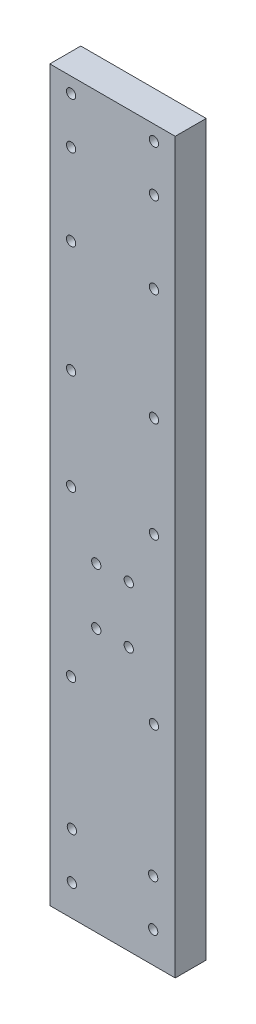
ISO-10303-21;
HEADER;
FILE_DESCRIPTION(('STEP AP214'),'2;1');
FILE_NAME('part.step','',(''),(''),'','','');
FILE_SCHEMA(('AUTOMOTIVE_DESIGN { 1 0 10303 214 1 1 1 1 }'));
ENDSEC;
DATA;
#1=APPLICATION_CONTEXT('core data for automotive mechanical design processes');
#2=APPLICATION_PROTOCOL_DEFINITION('international standard','automotive_design',2000,#1);
#3=PRODUCT_CONTEXT('',#1,'mechanical');
#4=PRODUCT('Part','Part','',(#3));
#5=PRODUCT_RELATED_PRODUCT_CATEGORY('part','',(#4));
#6=PRODUCT_DEFINITION_FORMATION('','',#4);
#7=PRODUCT_DEFINITION_CONTEXT('part definition',#1,'design');
#8=PRODUCT_DEFINITION('design','',#6,#7);
#9=PRODUCT_DEFINITION_SHAPE('','',#8);
#10=(LENGTH_UNIT() NAMED_UNIT(*) SI_UNIT(.MILLI.,.METRE.));
#11=(NAMED_UNIT(*) PLANE_ANGLE_UNIT() SI_UNIT($,.RADIAN.));
#12=(NAMED_UNIT(*) SI_UNIT($,.STERADIAN.) SOLID_ANGLE_UNIT());
#13=UNCERTAINTY_MEASURE_WITH_UNIT(LENGTH_MEASURE(1.E-05),#10,'distance_accuracy_value','');
#14=(GEOMETRIC_REPRESENTATION_CONTEXT(3) GLOBAL_UNCERTAINTY_ASSIGNED_CONTEXT((#13)) GLOBAL_UNIT_ASSIGNED_CONTEXT((#10,
#11,#12)) REPRESENTATION_CONTEXT('',''));
#15=CARTESIAN_POINT('',(0.,0.,0.));
#16=DIRECTION('',(0.,0.,1.));
#17=DIRECTION('',(1.,0.,0.));
#18=AXIS2_PLACEMENT_3D('',#15,#16,#17);
#19=CARTESIAN_POINT('',(0.,0.,4.));
#20=DIRECTION('',(0.,0.,-1.));
#21=DIRECTION('',(-1.,0.,0.));
#22=AXIS2_PLACEMENT_3D('',#19,#20,#21);
#23=PLANE('',#22);
#24=CARTESIAN_POINT('',(2.7500000000009,92.0614488310554,4.));
#25=DIRECTION('',(0.,0.,1.));
#26=DIRECTION('',(-1.,0.,0.));
#27=AXIS2_PLACEMENT_3D('',#24,#25,#26);
#28=CIRCLE('',#27,0.600000000000001);
#29=CARTESIAN_POINT('',(2.1500000000009,92.0614488310554,4.));
#30=VERTEX_POINT('',#29);
#31=EDGE_CURVE('E217',#30,#30,#28,.T.);
#32=ORIENTED_EDGE('',*,*,#31,.F.);
#33=EDGE_LOOP('',(#32));
#34=FACE_BOUND('',#33,.T.);
#35=CARTESIAN_POINT('',(13.4500000000022,86.0614488310554,4.));
#36=DIRECTION('',(0.,0.,1.));
#37=DIRECTION('',(1.,0.,0.));
#38=AXIS2_PLACEMENT_3D('',#35,#36,#37);
#39=CIRCLE('',#38,0.600000000000001);
#40=CARTESIAN_POINT('',(14.0500000000022,86.0614488310554,4.));
#41=VERTEX_POINT('',#40);
#42=EDGE_CURVE('E205',#41,#41,#39,.T.);
#43=ORIENTED_EDGE('',*,*,#42,.F.);
#44=EDGE_LOOP('',(#43));
#45=FACE_BOUND('',#44,.T.);
#46=CARTESIAN_POINT('',(13.4500000000001,75.5614488310554,4.));
#47=DIRECTION('',(0.,0.,1.));
#48=DIRECTION('',(1.,0.,0.));
#49=AXIS2_PLACEMENT_3D('',#46,#47,#48);
#50=CIRCLE('',#49,0.600000000000001);
#51=CARTESIAN_POINT('',(14.0500000000001,75.5614488310554,4.));
#52=VERTEX_POINT('',#51);
#53=EDGE_CURVE('E193',#52,#52,#50,.T.);
#54=ORIENTED_EDGE('',*,*,#53,.F.);
#55=EDGE_LOOP('',(#54));
#56=FACE_BOUND('',#55,.T.);
#57=CARTESIAN_POINT('',(13.350000000001,3.84644883105539,4.));
#58=DIRECTION('',(0.,0.,1.));
#59=DIRECTION('',(-1.,0.,0.));
#60=AXIS2_PLACEMENT_3D('',#57,#58,#59);
#61=CIRCLE('',#60,0.6);
#62=CARTESIAN_POINT('',(12.750000000001,3.84644883105539,4.));
#63=VERTEX_POINT('',#62);
#64=EDGE_CURVE('E181',#63,#63,#61,.T.);
#65=ORIENTED_EDGE('',*,*,#64,.F.);
#66=EDGE_LOOP('',(#65));
#67=FACE_BOUND('',#66,.T.);
#68=CARTESIAN_POINT('',(2.84999999999999,3.84644883105539,4.));
#69=DIRECTION('',(0.,0.,1.));
#70=DIRECTION('',(1.,0.,0.));
#71=AXIS2_PLACEMENT_3D('',#68,#69,#70);
#72=CIRCLE('',#71,0.6);
#73=CARTESIAN_POINT('',(3.44999999999999,3.84644883105539,4.));
#74=VERTEX_POINT('',#73);
#75=EDGE_CURVE('E169',#74,#74,#72,.T.);
#76=ORIENTED_EDGE('',*,*,#75,.F.);
#77=EDGE_LOOP('',(#76));
#78=FACE_BOUND('',#77,.T.);
#79=CARTESIAN_POINT('',(2.85,9.84644883105539,4.));
#80=DIRECTION('',(0.,0.,1.));
#81=DIRECTION('',(1.,0.,0.));
#82=AXIS2_PLACEMENT_3D('',#79,#80,#81);
#83=CIRCLE('',#82,0.6);
#84=CARTESIAN_POINT('',(3.45,9.84644883105539,4.));
#85=VERTEX_POINT('',#84);
#86=EDGE_CURVE('E157',#85,#85,#83,.T.);
#87=ORIENTED_EDGE('',*,*,#86,.F.);
#88=EDGE_LOOP('',(#87));
#89=FACE_BOUND('',#88,.T.);
#90=CARTESIAN_POINT('',(13.4500000000001,48.1064488310554,4.));
#91=DIRECTION('',(0.,0.,1.));
#92=DIRECTION('',(1.,0.,0.));
#93=AXIS2_PLACEMENT_3D('',#90,#91,#92);
#94=CIRCLE('',#93,0.600000000000001);
#95=CARTESIAN_POINT('',(14.0500000000001,48.1064488310554,4.));
#96=VERTEX_POINT('',#95);
#97=EDGE_CURVE('E145',#96,#96,#94,.T.);
#98=ORIENTED_EDGE('',*,*,#97,.F.);
#99=EDGE_LOOP('',(#98));
#100=FACE_BOUND('',#99,.T.);
#101=CARTESIAN_POINT('',(13.4500000000001,26.8464488310553,4.));
#102=DIRECTION('',(0.,0.,1.));
#103=DIRECTION('',(1.,0.,0.));
#104=AXIS2_PLACEMENT_3D('',#101,#102,#103);
#105=CIRCLE('',#104,0.6);
#106=CARTESIAN_POINT('',(14.0500000000001,26.8464488310553,4.));
#107=VERTEX_POINT('',#106);
#108=EDGE_CURVE('E133',#107,#107,#105,.T.);
#109=ORIENTED_EDGE('',*,*,#108,.F.);
#110=EDGE_LOOP('',(#109));
#111=FACE_BOUND('',#110,.T.);
#112=CARTESIAN_POINT('',(10.2000000000001,33.846448831055,4.));
#113=DIRECTION('',(0.,0.,1.));
#114=DIRECTION('',(1.,0.,0.));
#115=AXIS2_PLACEMENT_3D('',#112,#113,#114);
#116=CIRCLE('',#115,0.600000000000001);
#117=CARTESIAN_POINT('',(10.8000000000001,33.846448831055,4.));
#118=VERTEX_POINT('',#117);
#119=EDGE_CURVE('E121',#118,#118,#116,.T.);
#120=ORIENTED_EDGE('',*,*,#119,.F.);
#121=EDGE_LOOP('',(#120));
#122=FACE_BOUND('',#121,.T.);
#123=CARTESIAN_POINT('',(10.2000000000001,41.1664488310547,4.));
#124=DIRECTION('',(0.,0.,1.));
#125=DIRECTION('',(1.,0.,0.));
#126=AXIS2_PLACEMENT_3D('',#123,#124,#125);
#127=CIRCLE('',#126,0.600000000000001);
#128=CARTESIAN_POINT('',(10.8000000000001,41.1664488310547,4.));
#129=VERTEX_POINT('',#128);
#130=EDGE_CURVE('E100',#129,#129,#127,.T.);
#131=ORIENTED_EDGE('',*,*,#130,.F.);
#132=EDGE_LOOP('',(#131));
#133=FACE_BOUND('',#132,.T.);
#134=DIRECTION('',(1.,0.,0.));
#135=VECTOR('',#134,1.);
#136=CARTESIAN_POINT('',(0.,-0.15355116894461,4.));
#137=LINE('',#136,#135);
#138=CARTESIAN_POINT('',(0.,-0.15355116894461,4.));
#139=VERTEX_POINT('',#138);
#140=CARTESIAN_POINT('',(16.2,-0.15355116894461,4.));
#141=VERTEX_POINT('',#140);
#142=EDGE_CURVE('E85',#139,#141,#137,.T.);
#143=ORIENTED_EDGE('',*,*,#142,.T.);
#144=DIRECTION('',(0.,1.,0.));
#145=VECTOR('',#144,1.);
#146=CARTESIAN_POINT('',(16.2,94.0064488310554,4.));
#147=LINE('',#146,#145);
#148=CARTESIAN_POINT('',(16.2,94.0064488310554,4.));
#149=VERTEX_POINT('',#148);
#150=EDGE_CURVE('E80',#141,#149,#147,.T.);
#151=ORIENTED_EDGE('',*,*,#150,.T.);
#152=DIRECTION('',(-1.,0.,0.));
#153=VECTOR('',#152,1.);
#154=CARTESIAN_POINT('',(0.,94.0064488310554,4.));
#155=LINE('',#154,#153);
#156=CARTESIAN_POINT('',(0.,94.0064488310554,4.));
#157=VERTEX_POINT('',#156);
#158=EDGE_CURVE('E83',#149,#157,#155,.T.);
#159=ORIENTED_EDGE('',*,*,#158,.T.);
#160=DIRECTION('',(0.,-1.,0.));
#161=VECTOR('',#160,1.);
#162=CARTESIAN_POINT('',(0.,94.0064488310554,4.));
#163=LINE('',#162,#161);
#164=EDGE_CURVE('E50',#157,#139,#163,.T.);
#165=ORIENTED_EDGE('',*,*,#164,.T.);
#166=EDGE_LOOP('',(#143,#151,#159,#165));
#167=FACE_BOUND('',#166,.T.);
#168=CARTESIAN_POINT('',(6.,41.1064488310554,4.));
#169=DIRECTION('',(0.,0.,1.));
#170=DIRECTION('',(1.,0.,0.));
#171=AXIS2_PLACEMENT_3D('',#168,#169,#170);
#172=CIRCLE('',#171,0.600000000000001);
#173=CARTESIAN_POINT('',(6.6,41.1064488310554,4.));
#174=VERTEX_POINT('',#173);
#175=EDGE_CURVE('E115',#174,#174,#172,.T.);
#176=ORIENTED_EDGE('',*,*,#175,.F.);
#177=EDGE_LOOP('',(#176));
#178=FACE_BOUND('',#177,.T.);
#179=CARTESIAN_POINT('',(6.,33.846448831055,4.));
#180=DIRECTION('',(0.,0.,1.));
#181=DIRECTION('',(1.,0.,0.));
#182=AXIS2_PLACEMENT_3D('',#179,#180,#181);
#183=CIRCLE('',#182,0.600000000000001);
#184=CARTESIAN_POINT('',(6.6,33.846448831055,4.));
#185=VERTEX_POINT('',#184);
#186=EDGE_CURVE('E127',#185,#185,#183,.T.);
#187=ORIENTED_EDGE('',*,*,#186,.F.);
#188=EDGE_LOOP('',(#187));
#189=FACE_BOUND('',#188,.T.);
#190=CARTESIAN_POINT('',(2.75000000000002,26.8464488310555,4.));
#191=DIRECTION('',(0.,0.,1.));
#192=DIRECTION('',(1.,0.,0.));
#193=AXIS2_PLACEMENT_3D('',#190,#191,#192);
#194=CIRCLE('',#193,0.6);
#195=CARTESIAN_POINT('',(3.35000000000002,26.8464488310555,4.));
#196=VERTEX_POINT('',#195);
#197=EDGE_CURVE('E139',#196,#196,#194,.T.);
#198=ORIENTED_EDGE('',*,*,#197,.F.);
#199=EDGE_LOOP('',(#198));
#200=FACE_BOUND('',#199,.T.);
#201=CARTESIAN_POINT('',(2.75000000000002,48.1064488310554,4.));
#202=DIRECTION('',(0.,0.,1.));
#203=DIRECTION('',(1.,0.,0.));
#204=AXIS2_PLACEMENT_3D('',#201,#202,#203);
#205=CIRCLE('',#204,0.600000000000001);
#206=CARTESIAN_POINT('',(3.35000000000002,48.1064488310554,4.));
#207=VERTEX_POINT('',#206);
#208=EDGE_CURVE('E151',#207,#207,#205,.T.);
#209=ORIENTED_EDGE('',*,*,#208,.F.);
#210=EDGE_LOOP('',(#209));
#211=FACE_BOUND('',#210,.T.);
#212=CARTESIAN_POINT('',(13.4500000000016,61.1064488310554,4.));
#213=DIRECTION('',(0.,0.,1.));
#214=DIRECTION('',(1.,0.,0.));
#215=AXIS2_PLACEMENT_3D('',#212,#213,#214);
#216=CIRCLE('',#215,0.600000000000001);
#217=CARTESIAN_POINT('',(14.0500000000016,61.1064488310554,4.));
#218=VERTEX_POINT('',#217);
#219=EDGE_CURVE('E163',#218,#218,#216,.T.);
#220=ORIENTED_EDGE('',*,*,#219,.F.);
#221=EDGE_LOOP('',(#220));
#222=FACE_BOUND('',#221,.T.);
#223=CARTESIAN_POINT('',(13.350000000001,9.84644883105539,4.));
#224=DIRECTION('',(0.,0.,1.));
#225=DIRECTION('',(-1.,0.,0.));
#226=AXIS2_PLACEMENT_3D('',#223,#224,#225);
#227=CIRCLE('',#226,0.6);
#228=CARTESIAN_POINT('',(12.750000000001,9.84644883105539,4.));
#229=VERTEX_POINT('',#228);
#230=EDGE_CURVE('E175',#229,#229,#227,.T.);
#231=ORIENTED_EDGE('',*,*,#230,.F.);
#232=EDGE_LOOP('',(#231));
#233=FACE_BOUND('',#232,.T.);
#234=CARTESIAN_POINT('',(2.75000000000136,61.1064488310554,4.));
#235=DIRECTION('',(0.,0.,1.));
#236=DIRECTION('',(1.,0.,0.));
#237=AXIS2_PLACEMENT_3D('',#234,#235,#236);
#238=CIRCLE('',#237,0.600000000000001);
#239=CARTESIAN_POINT('',(3.35000000000136,61.1064488310554,4.));
#240=VERTEX_POINT('',#239);
#241=EDGE_CURVE('E187',#240,#240,#238,.T.);
#242=ORIENTED_EDGE('',*,*,#241,.F.);
#243=EDGE_LOOP('',(#242));
#244=FACE_BOUND('',#243,.T.);
#245=CARTESIAN_POINT('',(2.75000000000002,75.5614488310554,4.));
#246=DIRECTION('',(0.,0.,1.));
#247=DIRECTION('',(1.,0.,0.));
#248=AXIS2_PLACEMENT_3D('',#245,#246,#247);
#249=CIRCLE('',#248,0.600000000000001);
#250=CARTESIAN_POINT('',(3.35000000000002,75.5614488310554,4.));
#251=VERTEX_POINT('',#250);
#252=EDGE_CURVE('E199',#251,#251,#249,.T.);
#253=ORIENTED_EDGE('',*,*,#252,.F.);
#254=EDGE_LOOP('',(#253));
#255=FACE_BOUND('',#254,.T.);
#256=CARTESIAN_POINT('',(2.7500000000009,86.0614488310554,4.));
#257=DIRECTION('',(0.,0.,1.));
#258=DIRECTION('',(1.,0.,0.));
#259=AXIS2_PLACEMENT_3D('',#256,#257,#258);
#260=CIRCLE('',#259,0.600000000000001);
#261=CARTESIAN_POINT('',(3.3500000000009,86.0614488310554,4.));
#262=VERTEX_POINT('',#261);
#263=EDGE_CURVE('E211',#262,#262,#260,.T.);
#264=ORIENTED_EDGE('',*,*,#263,.F.);
#265=EDGE_LOOP('',(#264));
#266=FACE_BOUND('',#265,.T.);
#267=CARTESIAN_POINT('',(13.4500000000022,92.0614488310554,4.));
#268=DIRECTION('',(0.,0.,1.));
#269=DIRECTION('',(-1.,0.,0.));
#270=AXIS2_PLACEMENT_3D('',#267,#268,#269);
#271=CIRCLE('',#270,0.600000000000001);
#272=CARTESIAN_POINT('',(12.8500000000022,92.0614488310554,4.));
#273=VERTEX_POINT('',#272);
#274=EDGE_CURVE('E223',#273,#273,#271,.T.);
#275=ORIENTED_EDGE('',*,*,#274,.F.);
#276=EDGE_LOOP('',(#275));
#277=FACE_BOUND('',#276,.T.);
#278=ADVANCED_FACE('F33',(#34,#45,#56,#67,#78,#89,#100,#111,#122,#133,#167,#178,#189,#200,#211,
#222,#233,#244,#255,#266,#277),#23,.F.);
#279=CARTESIAN_POINT('',(0.,0.,0.));
#280=DIRECTION('',(0.,0.,-1.));
#281=DIRECTION('',(-1.,0.,0.));
#282=AXIS2_PLACEMENT_3D('',#279,#280,#281);
#283=PLANE('',#282);
#284=CARTESIAN_POINT('',(2.7500000000009,92.0614488310554,0.));
#285=DIRECTION('',(0.,0.,1.));
#286=DIRECTION('',(-1.,0.,0.));
#287=AXIS2_PLACEMENT_3D('',#284,#285,#286);
#288=CIRCLE('',#287,0.600000000000001);
#289=CARTESIAN_POINT('',(2.1500000000009,92.0614488310554,0.));
#290=VERTEX_POINT('',#289);
#291=EDGE_CURVE('E220',#290,#290,#288,.T.);
#292=ORIENTED_EDGE('',*,*,#291,.T.);
#293=EDGE_LOOP('',(#292));
#294=FACE_BOUND('',#293,.T.);
#295=CARTESIAN_POINT('',(13.4500000000022,86.0614488310554,0.));
#296=DIRECTION('',(0.,0.,1.));
#297=DIRECTION('',(1.,0.,0.));
#298=AXIS2_PLACEMENT_3D('',#295,#296,#297);
#299=CIRCLE('',#298,0.600000000000001);
#300=CARTESIAN_POINT('',(14.0500000000022,86.0614488310554,0.));
#301=VERTEX_POINT('',#300);
#302=EDGE_CURVE('E208',#301,#301,#299,.T.);
#303=ORIENTED_EDGE('',*,*,#302,.T.);
#304=EDGE_LOOP('',(#303));
#305=FACE_BOUND('',#304,.T.);
#306=CARTESIAN_POINT('',(13.4500000000001,75.5614488310554,0.));
#307=DIRECTION('',(0.,0.,1.));
#308=DIRECTION('',(1.,0.,0.));
#309=AXIS2_PLACEMENT_3D('',#306,#307,#308);
#310=CIRCLE('',#309,0.600000000000001);
#311=CARTESIAN_POINT('',(14.0500000000001,75.5614488310554,0.));
#312=VERTEX_POINT('',#311);
#313=EDGE_CURVE('E196',#312,#312,#310,.T.);
#314=ORIENTED_EDGE('',*,*,#313,.T.);
#315=EDGE_LOOP('',(#314));
#316=FACE_BOUND('',#315,.T.);
#317=CARTESIAN_POINT('',(13.350000000001,3.84644883105539,0.));
#318=DIRECTION('',(0.,0.,1.));
#319=DIRECTION('',(-1.,0.,0.));
#320=AXIS2_PLACEMENT_3D('',#317,#318,#319);
#321=CIRCLE('',#320,0.6);
#322=CARTESIAN_POINT('',(12.750000000001,3.84644883105539,0.));
#323=VERTEX_POINT('',#322);
#324=EDGE_CURVE('E184',#323,#323,#321,.T.);
#325=ORIENTED_EDGE('',*,*,#324,.T.);
#326=EDGE_LOOP('',(#325));
#327=FACE_BOUND('',#326,.T.);
#328=CARTESIAN_POINT('',(2.84999999999999,3.84644883105539,0.));
#329=DIRECTION('',(0.,0.,1.));
#330=DIRECTION('',(1.,0.,0.));
#331=AXIS2_PLACEMENT_3D('',#328,#329,#330);
#332=CIRCLE('',#331,0.6);
#333=CARTESIAN_POINT('',(3.44999999999999,3.84644883105539,0.));
#334=VERTEX_POINT('',#333);
#335=EDGE_CURVE('E172',#334,#334,#332,.T.);
#336=ORIENTED_EDGE('',*,*,#335,.T.);
#337=EDGE_LOOP('',(#336));
#338=FACE_BOUND('',#337,.T.);
#339=CARTESIAN_POINT('',(2.85,9.84644883105539,0.));
#340=DIRECTION('',(0.,0.,1.));
#341=DIRECTION('',(1.,0.,0.));
#342=AXIS2_PLACEMENT_3D('',#339,#340,#341);
#343=CIRCLE('',#342,0.6);
#344=CARTESIAN_POINT('',(3.45,9.84644883105539,0.));
#345=VERTEX_POINT('',#344);
#346=EDGE_CURVE('E160',#345,#345,#343,.T.);
#347=ORIENTED_EDGE('',*,*,#346,.T.);
#348=EDGE_LOOP('',(#347));
#349=FACE_BOUND('',#348,.T.);
#350=CARTESIAN_POINT('',(13.4500000000001,48.1064488310554,0.));
#351=DIRECTION('',(0.,0.,1.));
#352=DIRECTION('',(1.,0.,0.));
#353=AXIS2_PLACEMENT_3D('',#350,#351,#352);
#354=CIRCLE('',#353,0.600000000000001);
#355=CARTESIAN_POINT('',(14.0500000000001,48.1064488310554,0.));
#356=VERTEX_POINT('',#355);
#357=EDGE_CURVE('E148',#356,#356,#354,.T.);
#358=ORIENTED_EDGE('',*,*,#357,.T.);
#359=EDGE_LOOP('',(#358));
#360=FACE_BOUND('',#359,.T.);
#361=CARTESIAN_POINT('',(13.4500000000001,26.8464488310553,0.));
#362=DIRECTION('',(0.,0.,1.));
#363=DIRECTION('',(1.,0.,0.));
#364=AXIS2_PLACEMENT_3D('',#361,#362,#363);
#365=CIRCLE('',#364,0.6);
#366=CARTESIAN_POINT('',(14.0500000000001,26.8464488310553,0.));
#367=VERTEX_POINT('',#366);
#368=EDGE_CURVE('E136',#367,#367,#365,.T.);
#369=ORIENTED_EDGE('',*,*,#368,.T.);
#370=EDGE_LOOP('',(#369));
#371=FACE_BOUND('',#370,.T.);
#372=CARTESIAN_POINT('',(10.2000000000001,33.846448831055,0.));
#373=DIRECTION('',(0.,0.,1.));
#374=DIRECTION('',(1.,0.,0.));
#375=AXIS2_PLACEMENT_3D('',#372,#373,#374);
#376=CIRCLE('',#375,0.600000000000001);
#377=CARTESIAN_POINT('',(10.8000000000001,33.846448831055,0.));
#378=VERTEX_POINT('',#377);
#379=EDGE_CURVE('E124',#378,#378,#376,.T.);
#380=ORIENTED_EDGE('',*,*,#379,.T.);
#381=EDGE_LOOP('',(#380));
#382=FACE_BOUND('',#381,.T.);
#383=CARTESIAN_POINT('',(10.2000000000001,41.1664488310547,0.));
#384=DIRECTION('',(0.,0.,1.));
#385=DIRECTION('',(1.,0.,0.));
#386=AXIS2_PLACEMENT_3D('',#383,#384,#385);
#387=CIRCLE('',#386,0.600000000000001);
#388=CARTESIAN_POINT('',(10.8000000000001,41.1664488310547,0.));
#389=VERTEX_POINT('',#388);
#390=EDGE_CURVE('E112',#389,#389,#387,.T.);
#391=ORIENTED_EDGE('',*,*,#390,.T.);
#392=EDGE_LOOP('',(#391));
#393=FACE_BOUND('',#392,.T.);
#394=DIRECTION('',(1.,0.,0.));
#395=VECTOR('',#394,1.);
#396=CARTESIAN_POINT('',(0.,-0.15355116894461,0.));
#397=LINE('',#396,#395);
#398=CARTESIAN_POINT('',(0.,-0.15355116894461,0.));
#399=VERTEX_POINT('',#398);
#400=CARTESIAN_POINT('',(16.2,-0.15355116894461,0.));
#401=VERTEX_POINT('',#400);
#402=EDGE_CURVE('E97',#399,#401,#397,.T.);
#403=ORIENTED_EDGE('',*,*,#402,.F.);
#404=DIRECTION('',(0.,-1.,0.));
#405=VECTOR('',#404,1.);
#406=CARTESIAN_POINT('',(0.,94.0064488310554,0.));
#407=LINE('',#406,#405);
#408=CARTESIAN_POINT('',(0.,94.0064488310554,0.));
#409=VERTEX_POINT('',#408);
#410=EDGE_CURVE('E73',#409,#399,#407,.T.);
#411=ORIENTED_EDGE('',*,*,#410,.F.);
#412=DIRECTION('',(-1.,0.,0.));
#413=VECTOR('',#412,1.);
#414=CARTESIAN_POINT('',(0.,94.0064488310554,0.));
#415=LINE('',#414,#413);
#416=CARTESIAN_POINT('',(16.2,94.0064488310554,0.));
#417=VERTEX_POINT('',#416);
#418=EDGE_CURVE('E67',#417,#409,#415,.T.);
#419=ORIENTED_EDGE('',*,*,#418,.F.);
#420=DIRECTION('',(0.,1.,0.));
#421=VECTOR('',#420,1.);
#422=CARTESIAN_POINT('',(16.2,94.0064488310554,0.));
#423=LINE('',#422,#421);
#424=EDGE_CURVE('E89',#401,#417,#423,.T.);
#425=ORIENTED_EDGE('',*,*,#424,.F.);
#426=EDGE_LOOP('',(#403,#411,#419,#425));
#427=FACE_BOUND('',#426,.T.);
#428=CARTESIAN_POINT('',(6.,41.1064488310554,0.));
#429=DIRECTION('',(0.,0.,1.));
#430=DIRECTION('',(1.,0.,0.));
#431=AXIS2_PLACEMENT_3D('',#428,#429,#430);
#432=CIRCLE('',#431,0.600000000000001);
#433=CARTESIAN_POINT('',(6.6,41.1064488310554,0.));
#434=VERTEX_POINT('',#433);
#435=EDGE_CURVE('E118',#434,#434,#432,.T.);
#436=ORIENTED_EDGE('',*,*,#435,.T.);
#437=EDGE_LOOP('',(#436));
#438=FACE_BOUND('',#437,.T.);
#439=CARTESIAN_POINT('',(6.,33.846448831055,0.));
#440=DIRECTION('',(0.,0.,1.));
#441=DIRECTION('',(1.,0.,0.));
#442=AXIS2_PLACEMENT_3D('',#439,#440,#441);
#443=CIRCLE('',#442,0.600000000000001);
#444=CARTESIAN_POINT('',(6.6,33.846448831055,0.));
#445=VERTEX_POINT('',#444);
#446=EDGE_CURVE('E130',#445,#445,#443,.T.);
#447=ORIENTED_EDGE('',*,*,#446,.T.);
#448=EDGE_LOOP('',(#447));
#449=FACE_BOUND('',#448,.T.);
#450=CARTESIAN_POINT('',(2.75000000000002,26.8464488310555,0.));
#451=DIRECTION('',(0.,0.,1.));
#452=DIRECTION('',(1.,0.,0.));
#453=AXIS2_PLACEMENT_3D('',#450,#451,#452);
#454=CIRCLE('',#453,0.6);
#455=CARTESIAN_POINT('',(3.35000000000002,26.8464488310555,0.));
#456=VERTEX_POINT('',#455);
#457=EDGE_CURVE('E142',#456,#456,#454,.T.);
#458=ORIENTED_EDGE('',*,*,#457,.T.);
#459=EDGE_LOOP('',(#458));
#460=FACE_BOUND('',#459,.T.);
#461=CARTESIAN_POINT('',(2.75000000000002,48.1064488310554,0.));
#462=DIRECTION('',(0.,0.,1.));
#463=DIRECTION('',(1.,0.,0.));
#464=AXIS2_PLACEMENT_3D('',#461,#462,#463);
#465=CIRCLE('',#464,0.600000000000001);
#466=CARTESIAN_POINT('',(3.35000000000002,48.1064488310554,0.));
#467=VERTEX_POINT('',#466);
#468=EDGE_CURVE('E154',#467,#467,#465,.T.);
#469=ORIENTED_EDGE('',*,*,#468,.T.);
#470=EDGE_LOOP('',(#469));
#471=FACE_BOUND('',#470,.T.);
#472=CARTESIAN_POINT('',(13.4500000000016,61.1064488310554,0.));
#473=DIRECTION('',(0.,0.,1.));
#474=DIRECTION('',(1.,0.,0.));
#475=AXIS2_PLACEMENT_3D('',#472,#473,#474);
#476=CIRCLE('',#475,0.600000000000001);
#477=CARTESIAN_POINT('',(14.0500000000016,61.1064488310554,0.));
#478=VERTEX_POINT('',#477);
#479=EDGE_CURVE('E166',#478,#478,#476,.T.);
#480=ORIENTED_EDGE('',*,*,#479,.T.);
#481=EDGE_LOOP('',(#480));
#482=FACE_BOUND('',#481,.T.);
#483=CARTESIAN_POINT('',(13.350000000001,9.84644883105539,0.));
#484=DIRECTION('',(0.,0.,1.));
#485=DIRECTION('',(-1.,0.,0.));
#486=AXIS2_PLACEMENT_3D('',#483,#484,#485);
#487=CIRCLE('',#486,0.6);
#488=CARTESIAN_POINT('',(12.750000000001,9.84644883105539,0.));
#489=VERTEX_POINT('',#488);
#490=EDGE_CURVE('E178',#489,#489,#487,.T.);
#491=ORIENTED_EDGE('',*,*,#490,.T.);
#492=EDGE_LOOP('',(#491));
#493=FACE_BOUND('',#492,.T.);
#494=CARTESIAN_POINT('',(2.75000000000136,61.1064488310554,0.));
#495=DIRECTION('',(0.,0.,1.));
#496=DIRECTION('',(1.,0.,0.));
#497=AXIS2_PLACEMENT_3D('',#494,#495,#496);
#498=CIRCLE('',#497,0.600000000000001);
#499=CARTESIAN_POINT('',(3.35000000000136,61.1064488310554,0.));
#500=VERTEX_POINT('',#499);
#501=EDGE_CURVE('E190',#500,#500,#498,.T.);
#502=ORIENTED_EDGE('',*,*,#501,.T.);
#503=EDGE_LOOP('',(#502));
#504=FACE_BOUND('',#503,.T.);
#505=CARTESIAN_POINT('',(2.75000000000002,75.5614488310554,0.));
#506=DIRECTION('',(0.,0.,1.));
#507=DIRECTION('',(1.,0.,0.));
#508=AXIS2_PLACEMENT_3D('',#505,#506,#507);
#509=CIRCLE('',#508,0.600000000000001);
#510=CARTESIAN_POINT('',(3.35000000000002,75.5614488310554,0.));
#511=VERTEX_POINT('',#510);
#512=EDGE_CURVE('E202',#511,#511,#509,.T.);
#513=ORIENTED_EDGE('',*,*,#512,.T.);
#514=EDGE_LOOP('',(#513));
#515=FACE_BOUND('',#514,.T.);
#516=CARTESIAN_POINT('',(2.7500000000009,86.0614488310554,0.));
#517=DIRECTION('',(0.,0.,1.));
#518=DIRECTION('',(1.,0.,0.));
#519=AXIS2_PLACEMENT_3D('',#516,#517,#518);
#520=CIRCLE('',#519,0.600000000000001);
#521=CARTESIAN_POINT('',(3.3500000000009,86.0614488310554,0.));
#522=VERTEX_POINT('',#521);
#523=EDGE_CURVE('E214',#522,#522,#520,.T.);
#524=ORIENTED_EDGE('',*,*,#523,.T.);
#525=EDGE_LOOP('',(#524));
#526=FACE_BOUND('',#525,.T.);
#527=CARTESIAN_POINT('',(13.4500000000022,92.0614488310554,0.));
#528=DIRECTION('',(0.,0.,1.));
#529=DIRECTION('',(-1.,0.,0.));
#530=AXIS2_PLACEMENT_3D('',#527,#528,#529);
#531=CIRCLE('',#530,0.600000000000001);
#532=CARTESIAN_POINT('',(12.8500000000022,92.0614488310554,0.));
#533=VERTEX_POINT('',#532);
#534=EDGE_CURVE('E226',#533,#533,#531,.T.);
#535=ORIENTED_EDGE('',*,*,#534,.T.);
#536=EDGE_LOOP('',(#535));
#537=FACE_BOUND('',#536,.T.);
#538=ADVANCED_FACE('F108',(#294,#305,#316,#327,#338,#349,#360,#371,#382,#393,#427,#438,#449,
#460,#471,#482,#493,#504,#515,#526,#537),#283,.T.);
#539=CARTESIAN_POINT('',(0.,-0.15355116894461,4.));
#540=DIRECTION('',(0.,1.,0.));
#541=DIRECTION('',(0.,0.,1.));
#542=AXIS2_PLACEMENT_3D('',#539,#540,#541);
#543=PLANE('',#542);
#544=ORIENTED_EDGE('',*,*,#402,.T.);
#545=DIRECTION('',(0.,0.,-1.));
#546=VECTOR('',#545,1.);
#547=CARTESIAN_POINT('',(16.2,-0.15355116894461,4.));
#548=LINE('',#547,#546);
#549=EDGE_CURVE('E11',#141,#401,#548,.T.);
#550=ORIENTED_EDGE('',*,*,#549,.F.);
#551=ORIENTED_EDGE('',*,*,#142,.F.);
#552=DIRECTION('',(0.,0.,-1.));
#553=VECTOR('',#552,1.);
#554=CARTESIAN_POINT('',(0.,-0.15355116894461,4.));
#555=LINE('',#554,#553);
#556=EDGE_CURVE('E93',#139,#399,#555,.T.);
#557=ORIENTED_EDGE('',*,*,#556,.T.);
#558=EDGE_LOOP('',(#544,#550,#551,#557));
#559=FACE_BOUND('',#558,.T.);
#560=ADVANCED_FACE('F35',(#559),#543,.F.);
#561=CARTESIAN_POINT('',(16.2,94.0064488310554,4.));
#562=DIRECTION('',(-1.,0.,0.));
#563=DIRECTION('',(0.,-1.,0.));
#564=AXIS2_PLACEMENT_3D('',#561,#562,#563);
#565=PLANE('',#564);
#566=ORIENTED_EDGE('',*,*,#424,.T.);
#567=DIRECTION('',(0.,0.,-1.));
#568=VECTOR('',#567,1.);
#569=CARTESIAN_POINT('',(16.2,94.0064488310554,4.));
#570=LINE('',#569,#568);
#571=EDGE_CURVE('E42',#149,#417,#570,.T.);
#572=ORIENTED_EDGE('',*,*,#571,.F.);
#573=ORIENTED_EDGE('',*,*,#150,.F.);
#574=ORIENTED_EDGE('',*,*,#549,.T.);
#575=EDGE_LOOP('',(#566,#572,#573,#574));
#576=FACE_BOUND('',#575,.T.);
#577=ADVANCED_FACE('F88',(#576),#565,.F.);
#578=CARTESIAN_POINT('',(0.,94.0064488310554,4.));
#579=DIRECTION('',(0.,-1.,0.));
#580=DIRECTION('',(0.,0.,-1.));
#581=AXIS2_PLACEMENT_3D('',#578,#579,#580);
#582=PLANE('',#581);
#583=ORIENTED_EDGE('',*,*,#418,.T.);
#584=DIRECTION('',(0.,0.,-1.));
#585=VECTOR('',#584,1.);
#586=CARTESIAN_POINT('',(0.,94.0064488310554,4.));
#587=LINE('',#586,#585);
#588=EDGE_CURVE('E90',#157,#409,#587,.T.);
#589=ORIENTED_EDGE('',*,*,#588,.F.);
#590=ORIENTED_EDGE('',*,*,#158,.F.);
#591=ORIENTED_EDGE('',*,*,#571,.T.);
#592=EDGE_LOOP('',(#583,#589,#590,#591));
#593=FACE_BOUND('',#592,.T.);
#594=ADVANCED_FACE('F91',(#593),#582,.F.);
#595=CARTESIAN_POINT('',(0.,94.0064488310554,4.));
#596=DIRECTION('',(1.,0.,0.));
#597=DIRECTION('',(0.,1.,0.));
#598=AXIS2_PLACEMENT_3D('',#595,#596,#597);
#599=PLANE('',#598);
#600=ORIENTED_EDGE('',*,*,#410,.T.);
#601=ORIENTED_EDGE('',*,*,#556,.F.);
#602=ORIENTED_EDGE('',*,*,#164,.F.);
#603=ORIENTED_EDGE('',*,*,#588,.T.);
#604=EDGE_LOOP('',(#600,#601,#602,#603));
#605=FACE_BOUND('',#604,.T.);
#606=ADVANCED_FACE('F105',(#605),#599,.F.);
#607=CARTESIAN_POINT('',(10.2000000000001,41.1664488310547,4.));
#608=DIRECTION('',(0.,0.,-1.));
#609=DIRECTION('',(-1.,0.,0.));
#610=AXIS2_PLACEMENT_3D('',#607,#608,#609);
#611=CYLINDRICAL_SURFACE('',#610,0.600000000000001);
#612=ORIENTED_EDGE('',*,*,#130,.T.);
#613=EDGE_LOOP('',(#612));
#614=FACE_BOUND('',#613,.T.);
#615=ORIENTED_EDGE('',*,*,#390,.F.);
#616=EDGE_LOOP('',(#615));
#617=FACE_BOUND('',#616,.T.);
#618=ADVANCED_FACE('F246',(#614,#617),#611,.F.);
#619=CARTESIAN_POINT('',(6.,41.1064488310554,4.));
#620=DIRECTION('',(0.,0.,-1.));
#621=DIRECTION('',(-1.,0.,0.));
#622=AXIS2_PLACEMENT_3D('',#619,#620,#621);
#623=CYLINDRICAL_SURFACE('',#622,0.600000000000001);
#624=ORIENTED_EDGE('',*,*,#175,.T.);
#625=EDGE_LOOP('',(#624));
#626=FACE_BOUND('',#625,.T.);
#627=ORIENTED_EDGE('',*,*,#435,.F.);
#628=EDGE_LOOP('',(#627));
#629=FACE_BOUND('',#628,.T.);
#630=ADVANCED_FACE('F292',(#626,#629),#623,.F.);
#631=CARTESIAN_POINT('',(10.2000000000001,33.846448831055,4.));
#632=DIRECTION('',(0.,0.,-1.));
#633=DIRECTION('',(-1.,0.,0.));
#634=AXIS2_PLACEMENT_3D('',#631,#632,#633);
#635=CYLINDRICAL_SURFACE('',#634,0.600000000000001);
#636=ORIENTED_EDGE('',*,*,#119,.T.);
#637=EDGE_LOOP('',(#636));
#638=FACE_BOUND('',#637,.T.);
#639=ORIENTED_EDGE('',*,*,#379,.F.);
#640=EDGE_LOOP('',(#639));
#641=FACE_BOUND('',#640,.T.);
#642=ADVANCED_FACE('F300',(#638,#641),#635,.F.);
#643=CARTESIAN_POINT('',(6.,33.846448831055,4.));
#644=DIRECTION('',(0.,0.,-1.));
#645=DIRECTION('',(-1.,0.,0.));
#646=AXIS2_PLACEMENT_3D('',#643,#644,#645);
#647=CYLINDRICAL_SURFACE('',#646,0.600000000000001);
#648=ORIENTED_EDGE('',*,*,#186,.T.);
#649=EDGE_LOOP('',(#648));
#650=FACE_BOUND('',#649,.T.);
#651=ORIENTED_EDGE('',*,*,#446,.F.);
#652=EDGE_LOOP('',(#651));
#653=FACE_BOUND('',#652,.T.);
#654=ADVANCED_FACE('F308',(#650,#653),#647,.F.);
#655=CARTESIAN_POINT('',(13.4500000000001,26.8464488310553,4.));
#656=DIRECTION('',(0.,0.,-1.));
#657=DIRECTION('',(-1.,0.,0.));
#658=AXIS2_PLACEMENT_3D('',#655,#656,#657);
#659=CYLINDRICAL_SURFACE('',#658,0.6);
#660=ORIENTED_EDGE('',*,*,#108,.T.);
#661=EDGE_LOOP('',(#660));
#662=FACE_BOUND('',#661,.T.);
#663=ORIENTED_EDGE('',*,*,#368,.F.);
#664=EDGE_LOOP('',(#663));
#665=FACE_BOUND('',#664,.T.);
#666=ADVANCED_FACE('F317',(#662,#665),#659,.F.);
#667=CARTESIAN_POINT('',(2.75000000000002,26.8464488310555,4.));
#668=DIRECTION('',(0.,0.,-1.));
#669=DIRECTION('',(-1.,0.,0.));
#670=AXIS2_PLACEMENT_3D('',#667,#668,#669);
#671=CYLINDRICAL_SURFACE('',#670,0.6);
#672=ORIENTED_EDGE('',*,*,#197,.T.);
#673=EDGE_LOOP('',(#672));
#674=FACE_BOUND('',#673,.T.);
#675=ORIENTED_EDGE('',*,*,#457,.F.);
#676=EDGE_LOOP('',(#675));
#677=FACE_BOUND('',#676,.T.);
#678=ADVANCED_FACE('F326',(#674,#677),#671,.F.);
#679=CARTESIAN_POINT('',(13.4500000000001,48.1064488310554,4.));
#680=DIRECTION('',(0.,0.,-1.));
#681=DIRECTION('',(-1.,0.,0.));
#682=AXIS2_PLACEMENT_3D('',#679,#680,#681);
#683=CYLINDRICAL_SURFACE('',#682,0.600000000000001);
#684=ORIENTED_EDGE('',*,*,#97,.T.);
#685=EDGE_LOOP('',(#684));
#686=FACE_BOUND('',#685,.T.);
#687=ORIENTED_EDGE('',*,*,#357,.F.);
#688=EDGE_LOOP('',(#687));
#689=FACE_BOUND('',#688,.T.);
#690=ADVANCED_FACE('F335',(#686,#689),#683,.F.);
#691=CARTESIAN_POINT('',(2.75000000000002,48.1064488310554,4.));
#692=DIRECTION('',(0.,0.,-1.));
#693=DIRECTION('',(-1.,0.,0.));
#694=AXIS2_PLACEMENT_3D('',#691,#692,#693);
#695=CYLINDRICAL_SURFACE('',#694,0.600000000000001);
#696=ORIENTED_EDGE('',*,*,#208,.T.);
#697=EDGE_LOOP('',(#696));
#698=FACE_BOUND('',#697,.T.);
#699=ORIENTED_EDGE('',*,*,#468,.F.);
#700=EDGE_LOOP('',(#699));
#701=FACE_BOUND('',#700,.T.);
#702=ADVANCED_FACE('F344',(#698,#701),#695,.F.);
#703=CARTESIAN_POINT('',(2.85,9.84644883105539,4.));
#704=DIRECTION('',(0.,0.,-1.));
#705=DIRECTION('',(-1.,0.,0.));
#706=AXIS2_PLACEMENT_3D('',#703,#704,#705);
#707=CYLINDRICAL_SURFACE('',#706,0.6);
#708=ORIENTED_EDGE('',*,*,#86,.T.);
#709=EDGE_LOOP('',(#708));
#710=FACE_BOUND('',#709,.T.);
#711=ORIENTED_EDGE('',*,*,#346,.F.);
#712=EDGE_LOOP('',(#711));
#713=FACE_BOUND('',#712,.T.);
#714=ADVANCED_FACE('F353',(#710,#713),#707,.F.);
#715=CARTESIAN_POINT('',(13.4500000000016,61.1064488310554,4.));
#716=DIRECTION('',(0.,0.,-1.));
#717=DIRECTION('',(-1.,0.,0.));
#718=AXIS2_PLACEMENT_3D('',#715,#716,#717);
#719=CYLINDRICAL_SURFACE('',#718,0.600000000000001);
#720=ORIENTED_EDGE('',*,*,#219,.T.);
#721=EDGE_LOOP('',(#720));
#722=FACE_BOUND('',#721,.T.);
#723=ORIENTED_EDGE('',*,*,#479,.F.);
#724=EDGE_LOOP('',(#723));
#725=FACE_BOUND('',#724,.T.);
#726=ADVANCED_FACE('F362',(#722,#725),#719,.F.);
#727=CARTESIAN_POINT('',(2.84999999999999,3.84644883105539,4.));
#728=DIRECTION('',(0.,0.,-1.));
#729=DIRECTION('',(-1.,0.,0.));
#730=AXIS2_PLACEMENT_3D('',#727,#728,#729);
#731=CYLINDRICAL_SURFACE('',#730,0.6);
#732=ORIENTED_EDGE('',*,*,#75,.T.);
#733=EDGE_LOOP('',(#732));
#734=FACE_BOUND('',#733,.T.);
#735=ORIENTED_EDGE('',*,*,#335,.F.);
#736=EDGE_LOOP('',(#735));
#737=FACE_BOUND('',#736,.T.);
#738=ADVANCED_FACE('F371',(#734,#737),#731,.F.);
#739=CARTESIAN_POINT('',(13.350000000001,9.84644883105539,4.));
#740=DIRECTION('',(0.,0.,-1.));
#741=DIRECTION('',(-1.,0.,0.));
#742=AXIS2_PLACEMENT_3D('',#739,#740,#741);
#743=CYLINDRICAL_SURFACE('',#742,0.6);
#744=ORIENTED_EDGE('',*,*,#230,.T.);
#745=EDGE_LOOP('',(#744));
#746=FACE_BOUND('',#745,.T.);
#747=ORIENTED_EDGE('',*,*,#490,.F.);
#748=EDGE_LOOP('',(#747));
#749=FACE_BOUND('',#748,.T.);
#750=ADVANCED_FACE('F380',(#746,#749),#743,.F.);
#751=CARTESIAN_POINT('',(13.350000000001,3.84644883105539,4.));
#752=DIRECTION('',(0.,0.,-1.));
#753=DIRECTION('',(-1.,0.,0.));
#754=AXIS2_PLACEMENT_3D('',#751,#752,#753);
#755=CYLINDRICAL_SURFACE('',#754,0.6);
#756=ORIENTED_EDGE('',*,*,#64,.T.);
#757=EDGE_LOOP('',(#756));
#758=FACE_BOUND('',#757,.T.);
#759=ORIENTED_EDGE('',*,*,#324,.F.);
#760=EDGE_LOOP('',(#759));
#761=FACE_BOUND('',#760,.T.);
#762=ADVANCED_FACE('F389',(#758,#761),#755,.F.);
#763=CARTESIAN_POINT('',(2.75000000000136,61.1064488310554,4.));
#764=DIRECTION('',(0.,0.,-1.));
#765=DIRECTION('',(-1.,0.,0.));
#766=AXIS2_PLACEMENT_3D('',#763,#764,#765);
#767=CYLINDRICAL_SURFACE('',#766,0.600000000000001);
#768=ORIENTED_EDGE('',*,*,#241,.T.);
#769=EDGE_LOOP('',(#768));
#770=FACE_BOUND('',#769,.T.);
#771=ORIENTED_EDGE('',*,*,#501,.F.);
#772=EDGE_LOOP('',(#771));
#773=FACE_BOUND('',#772,.T.);
#774=ADVANCED_FACE('F398',(#770,#773),#767,.F.);
#775=CARTESIAN_POINT('',(13.4500000000001,75.5614488310554,4.));
#776=DIRECTION('',(0.,0.,-1.));
#777=DIRECTION('',(-1.,0.,0.));
#778=AXIS2_PLACEMENT_3D('',#775,#776,#777);
#779=CYLINDRICAL_SURFACE('',#778,0.600000000000001);
#780=ORIENTED_EDGE('',*,*,#53,.T.);
#781=EDGE_LOOP('',(#780));
#782=FACE_BOUND('',#781,.T.);
#783=ORIENTED_EDGE('',*,*,#313,.F.);
#784=EDGE_LOOP('',(#783));
#785=FACE_BOUND('',#784,.T.);
#786=ADVANCED_FACE('F407',(#782,#785),#779,.F.);
#787=CARTESIAN_POINT('',(2.75000000000002,75.5614488310554,4.));
#788=DIRECTION('',(0.,0.,-1.));
#789=DIRECTION('',(-1.,0.,0.));
#790=AXIS2_PLACEMENT_3D('',#787,#788,#789);
#791=CYLINDRICAL_SURFACE('',#790,0.600000000000001);
#792=ORIENTED_EDGE('',*,*,#252,.T.);
#793=EDGE_LOOP('',(#792));
#794=FACE_BOUND('',#793,.T.);
#795=ORIENTED_EDGE('',*,*,#512,.F.);
#796=EDGE_LOOP('',(#795));
#797=FACE_BOUND('',#796,.T.);
#798=ADVANCED_FACE('F416',(#794,#797),#791,.F.);
#799=CARTESIAN_POINT('',(13.4500000000022,86.0614488310554,4.));
#800=DIRECTION('',(0.,0.,-1.));
#801=DIRECTION('',(-1.,0.,0.));
#802=AXIS2_PLACEMENT_3D('',#799,#800,#801);
#803=CYLINDRICAL_SURFACE('',#802,0.600000000000001);
#804=ORIENTED_EDGE('',*,*,#42,.T.);
#805=EDGE_LOOP('',(#804));
#806=FACE_BOUND('',#805,.T.);
#807=ORIENTED_EDGE('',*,*,#302,.F.);
#808=EDGE_LOOP('',(#807));
#809=FACE_BOUND('',#808,.T.);
#810=ADVANCED_FACE('F425',(#806,#809),#803,.F.);
#811=CARTESIAN_POINT('',(2.7500000000009,86.0614488310554,4.));
#812=DIRECTION('',(0.,0.,-1.));
#813=DIRECTION('',(-1.,0.,0.));
#814=AXIS2_PLACEMENT_3D('',#811,#812,#813);
#815=CYLINDRICAL_SURFACE('',#814,0.600000000000001);
#816=ORIENTED_EDGE('',*,*,#263,.T.);
#817=EDGE_LOOP('',(#816));
#818=FACE_BOUND('',#817,.T.);
#819=ORIENTED_EDGE('',*,*,#523,.F.);
#820=EDGE_LOOP('',(#819));
#821=FACE_BOUND('',#820,.T.);
#822=ADVANCED_FACE('F434',(#818,#821),#815,.F.);
#823=CARTESIAN_POINT('',(2.7500000000009,92.0614488310554,4.));
#824=DIRECTION('',(0.,0.,-1.));
#825=DIRECTION('',(-1.,0.,0.));
#826=AXIS2_PLACEMENT_3D('',#823,#824,#825);
#827=CYLINDRICAL_SURFACE('',#826,0.600000000000001);
#828=ORIENTED_EDGE('',*,*,#31,.T.);
#829=EDGE_LOOP('',(#828));
#830=FACE_BOUND('',#829,.T.);
#831=ORIENTED_EDGE('',*,*,#291,.F.);
#832=EDGE_LOOP('',(#831));
#833=FACE_BOUND('',#832,.T.);
#834=ADVANCED_FACE('F443',(#830,#833),#827,.F.);
#835=CARTESIAN_POINT('',(13.4500000000022,92.0614488310554,4.));
#836=DIRECTION('',(0.,0.,-1.));
#837=DIRECTION('',(-1.,0.,0.));
#838=AXIS2_PLACEMENT_3D('',#835,#836,#837);
#839=CYLINDRICAL_SURFACE('',#838,0.600000000000001);
#840=ORIENTED_EDGE('',*,*,#274,.T.);
#841=EDGE_LOOP('',(#840));
#842=FACE_BOUND('',#841,.T.);
#843=ORIENTED_EDGE('',*,*,#534,.F.);
#844=EDGE_LOOP('',(#843));
#845=FACE_BOUND('',#844,.T.);
#846=ADVANCED_FACE('F232',(#842,#845),#839,.F.);
#847=CLOSED_SHELL('',(#278,#538,#560,#577,#594,#606,#618,#630,#642,#654,#666,#678,#690,#702,
#714,#726,#738,#750,#762,#774,#786,#798,#810,#822,#834,#846));
#848=MANIFOLD_SOLID_BREP('B2',#847);
#849=ADVANCED_BREP_SHAPE_REPRESENTATION('',(#18,#848),#14);
#850=SHAPE_DEFINITION_REPRESENTATION(#9,#849);
ENDSEC;
END-ISO-10303-21;
